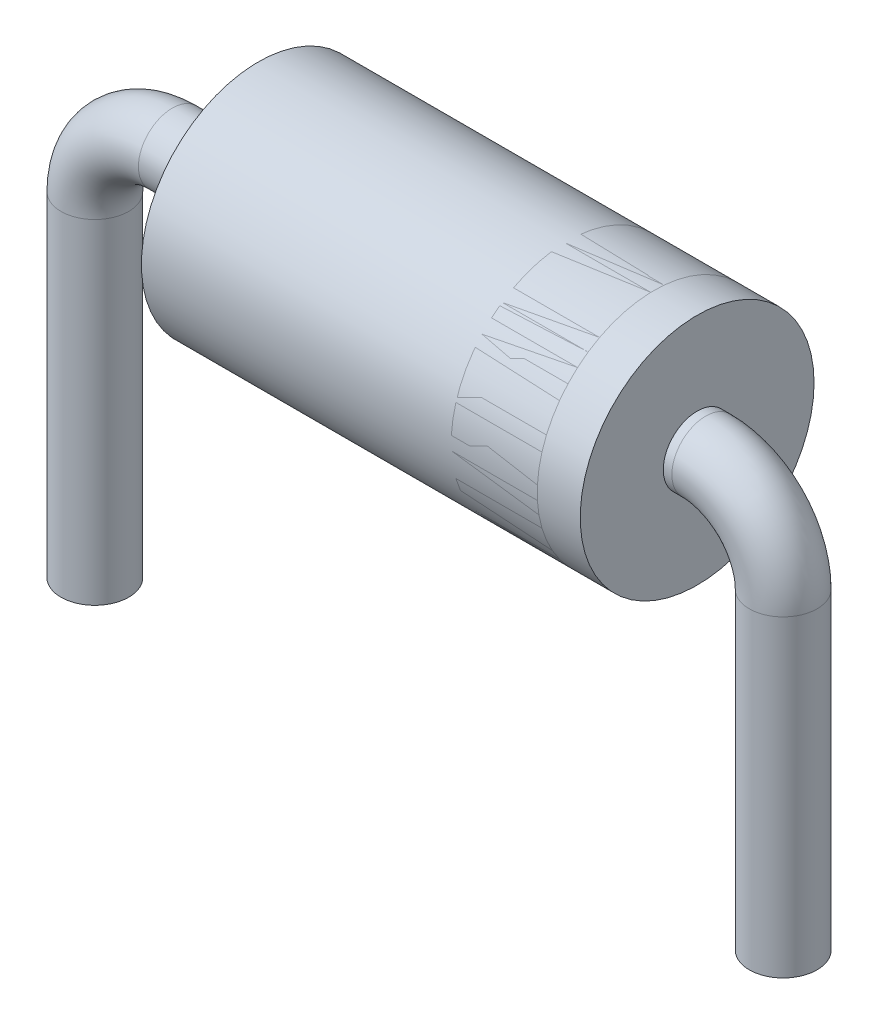
ISO-10303-21;
HEADER;
FILE_DESCRIPTION(('STEP AP214'),'2;1');
FILE_NAME('part.step','',(''),(''),'','','');
FILE_SCHEMA(('AUTOMOTIVE_DESIGN { 1 0 10303 214 1 1 1 1 }'));
ENDSEC;
DATA;
#1=APPLICATION_CONTEXT('core data for automotive mechanical design processes');
#2=APPLICATION_PROTOCOL_DEFINITION('international standard','automotive_design',2000,#1);
#3=PRODUCT_CONTEXT('',#1,'mechanical');
#4=PRODUCT('Part','Part','',(#3));
#5=PRODUCT_RELATED_PRODUCT_CATEGORY('part','',(#4));
#6=PRODUCT_DEFINITION_FORMATION('','',#4);
#7=PRODUCT_DEFINITION_CONTEXT('part definition',#1,'design');
#8=PRODUCT_DEFINITION('design','',#6,#7);
#9=PRODUCT_DEFINITION_SHAPE('','',#8);
#10=(LENGTH_UNIT() NAMED_UNIT(*) SI_UNIT(.MILLI.,.METRE.));
#11=(NAMED_UNIT(*) PLANE_ANGLE_UNIT() SI_UNIT($,.RADIAN.));
#12=(NAMED_UNIT(*) SI_UNIT($,.STERADIAN.) SOLID_ANGLE_UNIT());
#13=UNCERTAINTY_MEASURE_WITH_UNIT(LENGTH_MEASURE(1.E-05),#10,'distance_accuracy_value','');
#14=(GEOMETRIC_REPRESENTATION_CONTEXT(3) GLOBAL_UNCERTAINTY_ASSIGNED_CONTEXT((#13)) GLOBAL_UNIT_ASSIGNED_CONTEXT((#10,
#11,#12)) REPRESENTATION_CONTEXT('',''));
#15=CARTESIAN_POINT('',(0.,0.,0.));
#16=DIRECTION('',(0.,0.,1.));
#17=DIRECTION('',(1.,0.,0.));
#18=AXIS2_PLACEMENT_3D('',#15,#16,#17);
#19=CARTESIAN_POINT('',(-6.,-0.900000000000001,0.));
#20=DIRECTION('',(0.,-1.,0.));
#21=DIRECTION('',(1.,0.,0.));
#22=AXIS2_PLACEMENT_3D('',#19,#20,#21);
#23=CYLINDRICAL_SURFACE('',#22,0.3937);
#24=CARTESIAN_POINT('',(-6.,-0.900000000000001,0.));
#25=DIRECTION('',(0.,1.,0.));
#26=DIRECTION('',(0.,0.,-1.));
#27=AXIS2_PLACEMENT_3D('',#24,#25,#26);
#28=CIRCLE('',#27,0.3937);
#29=CARTESIAN_POINT('',(-6.3937,-0.900000000000001,0.));
#30=VERTEX_POINT('',#29);
#31=EDGE_CURVE('E45',#30,#30,#28,.T.);
#32=ORIENTED_EDGE('',*,*,#31,.F.);
#33=EDGE_LOOP('',(#32));
#34=FACE_BOUND('',#33,.T.);
#35=CARTESIAN_POINT('',(-6.,-4.78347314224206,0.));
#36=DIRECTION('',(0.,1.,0.));
#37=DIRECTION('',(0.,0.,-1.));
#38=AXIS2_PLACEMENT_3D('',#35,#36,#37);
#39=CIRCLE('',#38,0.3937);
#40=CARTESIAN_POINT('',(-6.,-4.78347314224206,-0.3937));
#41=VERTEX_POINT('',#40);
#42=EDGE_CURVE('E11',#41,#41,#39,.T.);
#43=ORIENTED_EDGE('',*,*,#42,.T.);
#44=EDGE_LOOP('',(#43));
#45=FACE_BOUND('',#44,.T.);
#46=ADVANCED_FACE('F39',(#34,#45),#23,.T.);
#47=CARTESIAN_POINT('',(-5.1,-0.900000000000001,0.));
#48=DIRECTION('',(0.,0.,1.));
#49=DIRECTION('',(1.,0.,0.));
#50=AXIS2_PLACEMENT_3D('',#47,#48,#49);
#51=TOROIDAL_SURFACE('',#50,0.9,0.3937);
#52=CARTESIAN_POINT('',(-5.1,0.,0.));
#53=DIRECTION('',(1.,0.,0.));
#54=DIRECTION('',(0.,0.,-1.));
#55=AXIS2_PLACEMENT_3D('',#52,#53,#54);
#56=CIRCLE('',#55,0.3937);
#57=CARTESIAN_POINT('',(-5.1,0.393699999999999,0.));
#58=VERTEX_POINT('',#57);
#59=EDGE_CURVE('E49',#58,#58,#56,.T.);
#60=CARTESIAN_POINT('',(-5.1,-0.900000000000001,0.));
#61=DIRECTION('',(0.,0.,1.));
#62=DIRECTION('',(1.,0.,0.));
#63=AXIS2_PLACEMENT_3D('',#60,#61,#62);
#64=CIRCLE('',#63,1.2937);
#65=EDGE_CURVE('',#58,#30,#64,.T.);
#66=ORIENTED_EDGE('',*,*,#59,.F.);
#67=ORIENTED_EDGE('',*,*,#31,.T.);
#68=ORIENTED_EDGE('',*,*,#65,.T.);
#69=ORIENTED_EDGE('',*,*,#65,.F.);
#70=EDGE_LOOP('',(#66,#68,#67,#69));
#71=FACE_BOUND('',#70,.T.);
#72=ADVANCED_FACE('F64',(#71),#51,.T.);
#73=CARTESIAN_POINT('',(-5.1,0.,0.));
#74=DIRECTION('',(1.,0.,0.));
#75=DIRECTION('',(0.,1.,0.));
#76=AXIS2_PLACEMENT_3D('',#73,#74,#75);
#77=CYLINDRICAL_SURFACE('',#76,0.3937);
#78=ORIENTED_EDGE('',*,*,#59,.T.);
#79=EDGE_LOOP('',(#78));
#80=FACE_BOUND('',#79,.T.);
#81=CARTESIAN_POINT('',(0.,0.,0.));
#82=DIRECTION('',(1.,0.,0.));
#83=DIRECTION('',(0.,0.,-1.));
#84=AXIS2_PLACEMENT_3D('',#81,#82,#83);
#85=CIRCLE('',#84,0.3937);
#86=CARTESIAN_POINT('',(0.,0.,-0.3937));
#87=VERTEX_POINT('',#86);
#88=EDGE_CURVE('E53',#87,#87,#85,.T.);
#89=ORIENTED_EDGE('',*,*,#88,.F.);
#90=EDGE_LOOP('',(#89));
#91=FACE_BOUND('',#90,.T.);
#92=ADVANCED_FACE('F61',(#80,#91),#77,.T.);
#93=CARTESIAN_POINT('',(-6.,-4.78347314224206,0.));
#94=DIRECTION('',(0.,1.,0.));
#95=DIRECTION('',(0.,0.,-1.));
#96=AXIS2_PLACEMENT_3D('',#93,#94,#95);
#97=PLANE('',#96);
#98=ORIENTED_EDGE('',*,*,#42,.F.);
#99=EDGE_LOOP('',(#98));
#100=FACE_BOUND('',#99,.T.);
#101=ADVANCED_FACE('F63',(#100),#97,.F.);
#102=CARTESIAN_POINT('',(0.,0.,0.));
#103=DIRECTION('',(1.,0.,0.));
#104=DIRECTION('',(0.,0.,-1.));
#105=AXIS2_PLACEMENT_3D('',#102,#103,#104);
#106=PLANE('',#105);
#107=ORIENTED_EDGE('',*,*,#88,.T.);
#108=EDGE_LOOP('',(#107));
#109=FACE_BOUND('',#108,.T.);
#110=ADVANCED_FACE('F59',(#109),#106,.T.);
#111=CLOSED_SHELL('',(#46,#72,#92,#101,#110));
#112=MANIFOLD_SOLID_BREP('B2',#111);
#113=CARTESIAN_POINT('',(2.,-0.9,0.));
#114=DIRECTION('',(0.,-1.,0.));
#115=DIRECTION('',(0.,0.,-1.));
#116=AXIS2_PLACEMENT_3D('',#113,#114,#115);
#117=CYLINDRICAL_SURFACE('',#116,0.3937);
#118=CARTESIAN_POINT('',(2.,-0.9,0.));
#119=DIRECTION('',(0.,-1.,0.));
#120=DIRECTION('',(0.,0.,-1.));
#121=AXIS2_PLACEMENT_3D('',#118,#119,#120);
#122=CIRCLE('',#121,0.3937);
#123=CARTESIAN_POINT('',(2.3937,-0.9,0.));
#124=VERTEX_POINT('',#123);
#125=EDGE_CURVE('E123',#124,#124,#122,.T.);
#126=ORIENTED_EDGE('',*,*,#125,.T.);
#127=EDGE_LOOP('',(#126));
#128=FACE_BOUND('',#127,.T.);
#129=CARTESIAN_POINT('',(2.,-4.53405043438451,0.));
#130=DIRECTION('',(0.,-1.,0.));
#131=DIRECTION('',(0.,0.,-1.));
#132=AXIS2_PLACEMENT_3D('',#129,#130,#131);
#133=CIRCLE('',#132,0.3937);
#134=CARTESIAN_POINT('',(2.,-4.53405043438451,-0.3937));
#135=VERTEX_POINT('',#134);
#136=EDGE_CURVE('E38',#135,#135,#133,.T.);
#137=ORIENTED_EDGE('',*,*,#136,.F.);
#138=EDGE_LOOP('',(#137));
#139=FACE_BOUND('',#138,.T.);
#140=ADVANCED_FACE('F117',(#128,#139),#117,.T.);
#141=CARTESIAN_POINT('',(1.1,-0.9,0.));
#142=DIRECTION('',(0.,0.,-1.));
#143=DIRECTION('',(-1.,0.,0.));
#144=AXIS2_PLACEMENT_3D('',#141,#142,#143);
#145=TOROIDAL_SURFACE('',#144,0.9,0.3937);
#146=CARTESIAN_POINT('',(1.1,0.,0.));
#147=DIRECTION('',(1.,0.,0.));
#148=DIRECTION('',(0.,0.,-1.));
#149=AXIS2_PLACEMENT_3D('',#146,#147,#148);
#150=CIRCLE('',#149,0.3937);
#151=CARTESIAN_POINT('',(1.1,0.3937,0.));
#152=VERTEX_POINT('',#151);
#153=EDGE_CURVE('E127',#152,#152,#150,.T.);
#154=CARTESIAN_POINT('',(1.1,-0.9,0.));
#155=DIRECTION('',(0.,0.,-1.));
#156=DIRECTION('',(-1.,0.,0.));
#157=AXIS2_PLACEMENT_3D('',#154,#155,#156);
#158=CIRCLE('',#157,1.2937);
#159=EDGE_CURVE('',#152,#124,#158,.T.);
#160=ORIENTED_EDGE('',*,*,#153,.T.);
#161=ORIENTED_EDGE('',*,*,#125,.F.);
#162=ORIENTED_EDGE('',*,*,#159,.T.);
#163=ORIENTED_EDGE('',*,*,#159,.F.);
#164=EDGE_LOOP('',(#160,#162,#161,#163));
#165=FACE_BOUND('',#164,.T.);
#166=ADVANCED_FACE('F149',(#165),#145,.T.);
#167=CARTESIAN_POINT('',(1.1,0.,0.));
#168=DIRECTION('',(-1.,0.,0.));
#169=DIRECTION('',(0.,-1.,0.));
#170=AXIS2_PLACEMENT_3D('',#167,#168,#169);
#171=CYLINDRICAL_SURFACE('',#170,0.3937);
#172=ORIENTED_EDGE('',*,*,#153,.F.);
#173=EDGE_LOOP('',(#172));
#174=FACE_BOUND('',#173,.T.);
#175=CARTESIAN_POINT('',(0.,0.,0.));
#176=DIRECTION('',(1.,0.,0.));
#177=DIRECTION('',(0.,0.,-1.));
#178=AXIS2_PLACEMENT_3D('',#175,#176,#177);
#179=CIRCLE('',#178,0.3937);
#180=CARTESIAN_POINT('',(0.,0.,-0.3937));
#181=VERTEX_POINT('',#180);
#182=EDGE_CURVE('E131',#181,#181,#179,.T.);
#183=ORIENTED_EDGE('',*,*,#182,.T.);
#184=EDGE_LOOP('',(#183));
#185=FACE_BOUND('',#184,.T.);
#186=ADVANCED_FACE('F137',(#174,#185),#171,.T.);
#187=CARTESIAN_POINT('',(2.,-4.53405043438451,0.));
#188=DIRECTION('',(0.,-1.,0.));
#189=DIRECTION('',(0.,0.,-1.));
#190=AXIS2_PLACEMENT_3D('',#187,#188,#189);
#191=PLANE('',#190);
#192=ORIENTED_EDGE('',*,*,#136,.T.);
#193=EDGE_LOOP('',(#192));
#194=FACE_BOUND('',#193,.T.);
#195=ADVANCED_FACE('F141',(#194),#191,.T.);
#196=CARTESIAN_POINT('',(0.,0.,0.));
#197=DIRECTION('',(1.,0.,0.));
#198=DIRECTION('',(0.,0.,-1.));
#199=AXIS2_PLACEMENT_3D('',#196,#197,#198);
#200=PLANE('',#199);
#201=ORIENTED_EDGE('',*,*,#182,.F.);
#202=EDGE_LOOP('',(#201));
#203=FACE_BOUND('',#202,.T.);
#204=ADVANCED_FACE('F139',(#203),#200,.F.);
#205=CLOSED_SHELL('',(#140,#166,#186,#195,#204));
#206=MANIFOLD_SOLID_BREP('B6',#205);
#207=CARTESIAN_POINT('',(-4.1,0.,0.));
#208=DIRECTION('',(1.,0.,0.));
#209=DIRECTION('',(0.,0.,-1.));
#210=AXIS2_PLACEMENT_3D('',#207,#208,#209);
#211=CYLINDRICAL_SURFACE('',#210,1.3589);
#212=CARTESIAN_POINT('',(-4.1,0.,0.));
#213=DIRECTION('',(1.,0.,0.));
#214=DIRECTION('',(0.,0.,-1.));
#215=AXIS2_PLACEMENT_3D('',#212,#213,#214);
#216=CIRCLE('',#215,1.3589);
#217=CARTESIAN_POINT('',(-4.1,0.,-1.3589));
#218=VERTEX_POINT('',#217);
#219=EDGE_CURVE('E116',#218,#218,#216,.T.);
#220=ORIENTED_EDGE('',*,*,#219,.T.);
#221=EDGE_LOOP('',(#220));
#222=FACE_BOUND('',#221,.T.);
#223=CARTESIAN_POINT('',(0.5,0.,0.));
#224=DIRECTION('',(1.,0.,0.));
#225=DIRECTION('',(0.,0.,-1.));
#226=AXIS2_PLACEMENT_3D('',#223,#224,#225);
#227=CIRCLE('',#226,1.3589);
#228=CARTESIAN_POINT('',(0.5,0.,-1.3589));
#229=VERTEX_POINT('',#228);
#230=EDGE_CURVE('E198',#229,#229,#227,.T.);
#231=ORIENTED_EDGE('',*,*,#230,.F.);
#232=EDGE_LOOP('',(#231));
#233=FACE_BOUND('',#232,.T.);
#234=ADVANCED_FACE('F195',(#222,#233),#211,.T.);
#235=CARTESIAN_POINT('',(-4.1,0.,0.));
#236=DIRECTION('',(1.,0.,0.));
#237=DIRECTION('',(0.,0.,-1.));
#238=AXIS2_PLACEMENT_3D('',#235,#236,#237);
#239=PLANE('',#238);
#240=ORIENTED_EDGE('',*,*,#219,.F.);
#241=EDGE_LOOP('',(#240));
#242=FACE_BOUND('',#241,.T.);
#243=ADVANCED_FACE('F210',(#242),#239,.F.);
#244=CARTESIAN_POINT('',(0.5,0.,0.));
#245=DIRECTION('',(1.,0.,0.));
#246=DIRECTION('',(0.,0.,-1.));
#247=AXIS2_PLACEMENT_3D('',#244,#245,#246);
#248=PLANE('',#247);
#249=ORIENTED_EDGE('',*,*,#230,.T.);
#250=EDGE_LOOP('',(#249));
#251=FACE_BOUND('',#250,.T.);
#252=ADVANCED_FACE('F207',(#251),#248,.T.);
#253=CLOSED_SHELL('',(#234,#243,#252));
#254=MANIFOLD_SOLID_BREP('B33',#253);
#255=CARTESIAN_POINT('',(1.,0.,0.));
#256=DIRECTION('',(-1.,0.,0.));
#257=DIRECTION('',(0.,0.,1.));
#258=AXIS2_PLACEMENT_3D('',#255,#256,#257);
#259=CYLINDRICAL_SURFACE('',#258,1.3589);
#260=CARTESIAN_POINT('',(1.,0.,0.));
#261=DIRECTION('',(1.,0.,0.));
#262=DIRECTION('',(0.,0.,-1.));
#263=AXIS2_PLACEMENT_3D('',#260,#261,#262);
#264=CIRCLE('',#263,1.3589);
#265=CARTESIAN_POINT('',(1.,0.,-1.3589));
#266=VERTEX_POINT('',#265);
#267=EDGE_CURVE('E194',#266,#266,#264,.T.);
#268=ORIENTED_EDGE('',*,*,#267,.F.);
#269=EDGE_LOOP('',(#268));
#270=FACE_BOUND('',#269,.T.);
#271=CARTESIAN_POINT('',(0.5,0.,0.));
#272=DIRECTION('',(1.,0.,0.));
#273=DIRECTION('',(0.,0.,-1.));
#274=AXIS2_PLACEMENT_3D('',#271,#272,#273);
#275=CIRCLE('',#274,1.3589);
#276=CARTESIAN_POINT('',(0.5,0.,-1.3589));
#277=VERTEX_POINT('',#276);
#278=EDGE_CURVE('E245',#277,#277,#275,.T.);
#279=ORIENTED_EDGE('',*,*,#278,.T.);
#280=EDGE_LOOP('',(#279));
#281=FACE_BOUND('',#280,.T.);
#282=ADVANCED_FACE('F242',(#270,#281),#259,.T.);
#283=CARTESIAN_POINT('',(1.,0.,0.));
#284=DIRECTION('',(1.,0.,0.));
#285=DIRECTION('',(0.,0.,-1.));
#286=AXIS2_PLACEMENT_3D('',#283,#284,#285);
#287=PLANE('',#286);
#288=ORIENTED_EDGE('',*,*,#267,.T.);
#289=EDGE_LOOP('',(#288));
#290=FACE_BOUND('',#289,.T.);
#291=ADVANCED_FACE('F257',(#290),#287,.T.);
#292=CARTESIAN_POINT('',(0.5,0.,0.));
#293=DIRECTION('',(1.,0.,0.));
#294=DIRECTION('',(0.,0.,-1.));
#295=AXIS2_PLACEMENT_3D('',#292,#293,#294);
#296=PLANE('',#295);
#297=ORIENTED_EDGE('',*,*,#278,.F.);
#298=EDGE_LOOP('',(#297));
#299=FACE_BOUND('',#298,.T.);
#300=ADVANCED_FACE('F255',(#299),#296,.F.);
#301=CLOSED_SHELL('',(#282,#291,#300));
#302=MANIFOLD_SOLID_BREP('B111',#301);
#303=CARTESIAN_POINT('',(-0.5,0.,0.));
#304=DIRECTION('',(1.,0.,0.));
#305=DIRECTION('',(0.,0.,-1.));
#306=AXIS2_PLACEMENT_3D('',#303,#304,#305);
#307=CYLINDRICAL_SURFACE('',#306,1.3589);
#308=CARTESIAN_POINT('',(-0.5,0.,0.));
#309=DIRECTION('',(1.,0.,0.));
#310=DIRECTION('',(0.,0.,-1.));
#311=AXIS2_PLACEMENT_3D('',#308,#309,#310);
#312=CIRCLE('',#311,1.3589);
#313=CARTESIAN_POINT('',(-0.5,0.,-1.3589));
#314=VERTEX_POINT('',#313);
#315=EDGE_CURVE('E241',#314,#314,#312,.T.);
#316=ORIENTED_EDGE('',*,*,#315,.T.);
#317=EDGE_LOOP('',(#316));
#318=FACE_BOUND('',#317,.T.);
#319=CARTESIAN_POINT('',(0.5,0.,0.));
#320=DIRECTION('',(1.,0.,0.));
#321=DIRECTION('',(0.,0.,-1.));
#322=AXIS2_PLACEMENT_3D('',#319,#320,#321);
#323=CIRCLE('',#322,1.3589);
#324=CARTESIAN_POINT('',(0.5,0.,-1.3589));
#325=VERTEX_POINT('',#324);
#326=EDGE_CURVE('E288',#325,#325,#323,.T.);
#327=ORIENTED_EDGE('',*,*,#326,.F.);
#328=EDGE_LOOP('',(#327));
#329=FACE_BOUND('',#328,.T.);
#330=ADVANCED_FACE('F282',(#318,#329),#307,.T.);
#331=CARTESIAN_POINT('',(-0.5,0.,0.));
#332=DIRECTION('',(1.,0.,0.));
#333=DIRECTION('',(0.,0.,-1.));
#334=AXIS2_PLACEMENT_3D('',#331,#332,#333);
#335=PLANE('',#334);
#336=ORIENTED_EDGE('',*,*,#315,.F.);
#337=EDGE_LOOP('',(#336));
#338=FACE_BOUND('',#337,.T.);
#339=ADVANCED_FACE('F297',(#338),#335,.F.);
#340=CARTESIAN_POINT('',(0.5,0.,0.));
#341=DIRECTION('',(1.,0.,0.));
#342=DIRECTION('',(0.,0.,-1.));
#343=AXIS2_PLACEMENT_3D('',#340,#341,#342);
#344=PLANE('',#343);
#345=ORIENTED_EDGE('',*,*,#326,.T.);
#346=EDGE_LOOP('',(#345));
#347=FACE_BOUND('',#346,.T.);
#348=ADVANCED_FACE('F294',(#347),#344,.T.);
#349=CLOSED_SHELL('',(#330,#339,#348));
#350=MANIFOLD_SOLID_BREP('B189',#349);
#351=ADVANCED_BREP_SHAPE_REPRESENTATION('',(#18,#112,#206,#254,#302,#350),#14);
#352=SHAPE_DEFINITION_REPRESENTATION(#9,#351);
ENDSEC;
END-ISO-10303-21;
